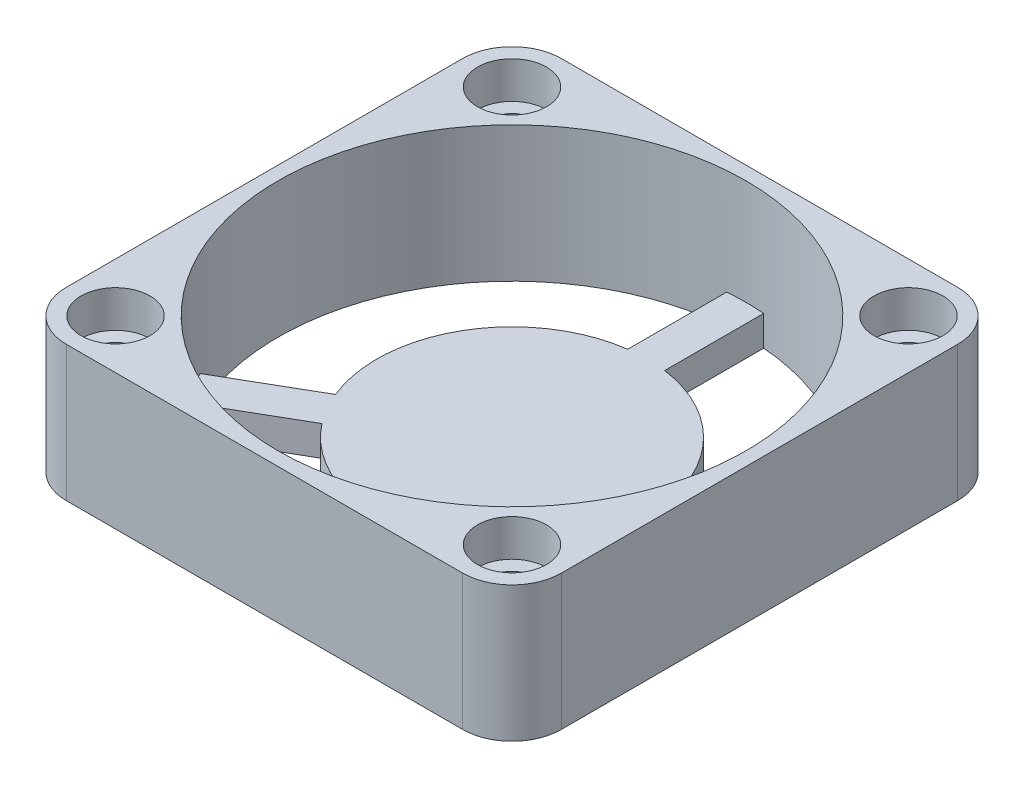
ISO-10303-21;
HEADER;
FILE_DESCRIPTION(('STEP AP214'),'2;1');
FILE_NAME('part.step','',(''),(''),'','','');
FILE_SCHEMA(('AUTOMOTIVE_DESIGN { 1 0 10303 214 1 1 1 1 }'));
ENDSEC;
DATA;
#1=APPLICATION_CONTEXT('core data for automotive mechanical design processes');
#2=APPLICATION_PROTOCOL_DEFINITION('international standard','automotive_design',2000,#1);
#3=PRODUCT_CONTEXT('',#1,'mechanical');
#4=PRODUCT('Part','Part','',(#3));
#5=PRODUCT_RELATED_PRODUCT_CATEGORY('part','',(#4));
#6=PRODUCT_DEFINITION_FORMATION('','',#4);
#7=PRODUCT_DEFINITION_CONTEXT('part definition',#1,'design');
#8=PRODUCT_DEFINITION('design','',#6,#7);
#9=PRODUCT_DEFINITION_SHAPE('','',#8);
#10=(LENGTH_UNIT() NAMED_UNIT(*) SI_UNIT(.MILLI.,.METRE.));
#11=(NAMED_UNIT(*) PLANE_ANGLE_UNIT() SI_UNIT($,.RADIAN.));
#12=(NAMED_UNIT(*) SI_UNIT($,.STERADIAN.) SOLID_ANGLE_UNIT());
#13=UNCERTAINTY_MEASURE_WITH_UNIT(LENGTH_MEASURE(1.E-05),#10,'distance_accuracy_value','');
#14=(GEOMETRIC_REPRESENTATION_CONTEXT(3) GLOBAL_UNCERTAINTY_ASSIGNED_CONTEXT((#13)) GLOBAL_UNIT_ASSIGNED_CONTEXT((#10,
#11,#12)) REPRESENTATION_CONTEXT('',''));
#15=CARTESIAN_POINT('',(0.,0.,0.));
#16=DIRECTION('',(0.,0.,1.));
#17=DIRECTION('',(1.,0.,0.));
#18=AXIS2_PLACEMENT_3D('',#15,#16,#17);
#19=CARTESIAN_POINT('',(16.1,5.5,16.1));
#20=DIRECTION('',(0.,-1.,0.));
#21=DIRECTION('',(0.,0.,-1.));
#22=AXIS2_PLACEMENT_3D('',#19,#20,#21);
#23=CYLINDRICAL_SURFACE('',#22,1.6);
#24=CARTESIAN_POINT('',(16.1,-5.5,16.1));
#25=DIRECTION('',(0.,-1.,0.));
#26=DIRECTION('',(0.,0.,1.));
#27=AXIS2_PLACEMENT_3D('',#24,#25,#26);
#28=CIRCLE('',#27,1.6);
#29=CARTESIAN_POINT('',(16.1,-5.5,17.7));
#30=VERTEX_POINT('',#29);
#31=EDGE_CURVE('E352',#30,#30,#28,.T.);
#32=ORIENTED_EDGE('',*,*,#31,.T.);
#33=EDGE_LOOP('',(#32));
#34=FACE_BOUND('',#33,.T.);
#35=CARTESIAN_POINT('',(16.1,2.5,16.1));
#36=DIRECTION('',(0.,1.,0.));
#37=DIRECTION('',(0.,0.,1.));
#38=AXIS2_PLACEMENT_3D('',#35,#36,#37);
#39=CIRCLE('',#38,1.6);
#40=CARTESIAN_POINT('',(16.1,2.5,17.7));
#41=VERTEX_POINT('',#40);
#42=EDGE_CURVE('E338',#41,#41,#39,.F.);
#43=ORIENTED_EDGE('',*,*,#42,.F.);
#44=EDGE_LOOP('',(#43));
#45=FACE_BOUND('',#44,.T.);
#46=ADVANCED_FACE('F39',(#34,#45),#23,.F.);
#47=CARTESIAN_POINT('',(-16.1,5.5,-16.1));
#48=DIRECTION('',(0.,-1.,0.));
#49=DIRECTION('',(0.,0.,-1.));
#50=AXIS2_PLACEMENT_3D('',#47,#48,#49);
#51=CYLINDRICAL_SURFACE('',#50,1.6);
#52=CARTESIAN_POINT('',(-16.1,-5.5,-16.1));
#53=DIRECTION('',(0.,-1.,0.));
#54=DIRECTION('',(0.,0.,1.));
#55=AXIS2_PLACEMENT_3D('',#52,#53,#54);
#56=CIRCLE('',#55,1.6);
#57=CARTESIAN_POINT('',(-16.1,-5.5,-14.5));
#58=VERTEX_POINT('',#57);
#59=EDGE_CURVE('E343',#58,#58,#56,.T.);
#60=ORIENTED_EDGE('',*,*,#59,.T.);
#61=EDGE_LOOP('',(#60));
#62=FACE_BOUND('',#61,.T.);
#63=CARTESIAN_POINT('',(-16.1,2.5,-16.1));
#64=DIRECTION('',(0.,1.,0.));
#65=DIRECTION('',(0.,0.,1.));
#66=AXIS2_PLACEMENT_3D('',#63,#64,#65);
#67=CIRCLE('',#66,1.6);
#68=CARTESIAN_POINT('',(-16.1,2.5,-14.5));
#69=VERTEX_POINT('',#68);
#70=EDGE_CURVE('E332',#69,#69,#67,.F.);
#71=ORIENTED_EDGE('',*,*,#70,.F.);
#72=EDGE_LOOP('',(#71));
#73=FACE_BOUND('',#72,.T.);
#74=ADVANCED_FACE('F411',(#62,#73),#51,.F.);
#75=CARTESIAN_POINT('',(16.1,5.5,16.1));
#76=DIRECTION('',(0.,-1.,0.));
#77=DIRECTION('',(0.,0.,-1.));
#78=AXIS2_PLACEMENT_3D('',#75,#76,#77);
#79=CYLINDRICAL_SURFACE('',#78,4.);
#80=CARTESIAN_POINT('',(16.1,-5.5,16.1));
#81=DIRECTION('',(0.,1.,0.));
#82=DIRECTION('',(0.,0.,1.));
#83=AXIS2_PLACEMENT_3D('',#80,#81,#82);
#84=CIRCLE('',#83,4.);
#85=CARTESIAN_POINT('',(16.1,-5.5,20.1));
#86=VERTEX_POINT('',#85);
#87=CARTESIAN_POINT('',(20.1,-5.5,16.1));
#88=VERTEX_POINT('',#87);
#89=EDGE_CURVE('E274',#86,#88,#84,.T.);
#90=ORIENTED_EDGE('',*,*,#89,.T.);
#91=DIRECTION('',(0.,-1.,0.));
#92=VECTOR('',#91,1.);
#93=CARTESIAN_POINT('',(20.1,5.5,16.1));
#94=LINE('',#93,#92);
#95=CARTESIAN_POINT('',(20.1,5.5,16.1));
#96=VERTEX_POINT('',#95);
#97=EDGE_CURVE('E11',#96,#88,#94,.T.);
#98=ORIENTED_EDGE('',*,*,#97,.F.);
#99=CARTESIAN_POINT('',(16.1,5.5,16.1));
#100=DIRECTION('',(0.,1.,0.));
#101=DIRECTION('',(0.,0.,1.));
#102=AXIS2_PLACEMENT_3D('',#99,#100,#101);
#103=CIRCLE('',#102,4.);
#104=CARTESIAN_POINT('',(16.1,5.5,20.1));
#105=VERTEX_POINT('',#104);
#106=EDGE_CURVE('E279',#105,#96,#103,.T.);
#107=ORIENTED_EDGE('',*,*,#106,.F.);
#108=DIRECTION('',(0.,-1.,0.));
#109=VECTOR('',#108,1.);
#110=CARTESIAN_POINT('',(16.1,5.5,20.1));
#111=LINE('',#110,#109);
#112=EDGE_CURVE('E297',#105,#86,#111,.T.);
#113=ORIENTED_EDGE('',*,*,#112,.T.);
#114=EDGE_LOOP('',(#90,#98,#107,#113));
#115=FACE_BOUND('',#114,.T.);
#116=ADVANCED_FACE('F41',(#115),#79,.T.);
#117=CARTESIAN_POINT('',(20.1,5.5,16.1));
#118=DIRECTION('',(-1.,0.,0.));
#119=DIRECTION('',(0.,0.,1.));
#120=AXIS2_PLACEMENT_3D('',#117,#118,#119);
#121=PLANE('',#120);
#122=DIRECTION('',(0.,0.,-1.));
#123=VECTOR('',#122,1.);
#124=CARTESIAN_POINT('',(20.1,-5.5,16.1));
#125=LINE('',#124,#123);
#126=CARTESIAN_POINT('',(20.1,-5.5,-16.1));
#127=VERTEX_POINT('',#126);
#128=EDGE_CURVE('E300',#88,#127,#125,.T.);
#129=ORIENTED_EDGE('',*,*,#128,.T.);
#130=DIRECTION('',(0.,-1.,0.));
#131=VECTOR('',#130,1.);
#132=CARTESIAN_POINT('',(20.1,5.5,-16.1));
#133=LINE('',#132,#131);
#134=CARTESIAN_POINT('',(20.1,5.5,-16.1));
#135=VERTEX_POINT('',#134);
#136=EDGE_CURVE('E48',#135,#127,#133,.T.);
#137=ORIENTED_EDGE('',*,*,#136,.F.);
#138=DIRECTION('',(0.,0.,-1.));
#139=VECTOR('',#138,1.);
#140=CARTESIAN_POINT('',(20.1,5.5,16.1));
#141=LINE('',#140,#139);
#142=EDGE_CURVE('E282',#96,#135,#141,.T.);
#143=ORIENTED_EDGE('',*,*,#142,.F.);
#144=ORIENTED_EDGE('',*,*,#97,.T.);
#145=EDGE_LOOP('',(#129,#137,#143,#144));
#146=FACE_BOUND('',#145,.T.);
#147=ADVANCED_FACE('F719',(#146),#121,.F.);
#148=CARTESIAN_POINT('',(16.1,5.5,-16.1));
#149=DIRECTION('',(0.,-1.,0.));
#150=DIRECTION('',(0.,0.,-1.));
#151=AXIS2_PLACEMENT_3D('',#148,#149,#150);
#152=CYLINDRICAL_SURFACE('',#151,4.);
#153=CARTESIAN_POINT('',(16.1,-5.5,-16.1));
#154=DIRECTION('',(0.,1.,0.));
#155=DIRECTION('',(0.,0.,-1.));
#156=AXIS2_PLACEMENT_3D('',#153,#154,#155);
#157=CIRCLE('',#156,4.);
#158=CARTESIAN_POINT('',(16.1,-5.5,-20.1));
#159=VERTEX_POINT('',#158);
#160=EDGE_CURVE('E302',#127,#159,#157,.T.);
#161=ORIENTED_EDGE('',*,*,#160,.T.);
#162=DIRECTION('',(0.,-1.,0.));
#163=VECTOR('',#162,1.);
#164=CARTESIAN_POINT('',(16.1,5.5,-20.1));
#165=LINE('',#164,#163);
#166=CARTESIAN_POINT('',(16.1,5.5,-20.1));
#167=VERTEX_POINT('',#166);
#168=EDGE_CURVE('E327',#167,#159,#165,.T.);
#169=ORIENTED_EDGE('',*,*,#168,.F.);
#170=CARTESIAN_POINT('',(16.1,5.5,-16.1));
#171=DIRECTION('',(0.,1.,0.));
#172=DIRECTION('',(0.,0.,-1.));
#173=AXIS2_PLACEMENT_3D('',#170,#171,#172);
#174=CIRCLE('',#173,4.);
#175=EDGE_CURVE('E285',#135,#167,#174,.T.);
#176=ORIENTED_EDGE('',*,*,#175,.F.);
#177=ORIENTED_EDGE('',*,*,#136,.T.);
#178=EDGE_LOOP('',(#161,#169,#176,#177));
#179=FACE_BOUND('',#178,.T.);
#180=ADVANCED_FACE('F708',(#179),#152,.T.);
#181=CARTESIAN_POINT('',(-16.1,5.5,-20.1));
#182=DIRECTION('',(0.,0.,1.));
#183=DIRECTION('',(1.,0.,0.));
#184=AXIS2_PLACEMENT_3D('',#181,#182,#183);
#185=PLANE('',#184);
#186=DIRECTION('',(-1.,0.,0.));
#187=VECTOR('',#186,1.);
#188=CARTESIAN_POINT('',(-16.1,-5.5,-20.1));
#189=LINE('',#188,#187);
#190=CARTESIAN_POINT('',(-16.1,-5.5,-20.1));
#191=VERTEX_POINT('',#190);
#192=EDGE_CURVE('E304',#159,#191,#189,.T.);
#193=ORIENTED_EDGE('',*,*,#192,.T.);
#194=DIRECTION('',(0.,-1.,0.));
#195=VECTOR('',#194,1.);
#196=CARTESIAN_POINT('',(-16.1,5.5,-20.1));
#197=LINE('',#196,#195);
#198=CARTESIAN_POINT('',(-16.1,5.5,-20.1));
#199=VERTEX_POINT('',#198);
#200=EDGE_CURVE('E324',#199,#191,#197,.T.);
#201=ORIENTED_EDGE('',*,*,#200,.F.);
#202=DIRECTION('',(-1.,0.,0.));
#203=VECTOR('',#202,1.);
#204=CARTESIAN_POINT('',(-16.1,5.5,-20.1));
#205=LINE('',#204,#203);
#206=EDGE_CURVE('E287',#167,#199,#205,.T.);
#207=ORIENTED_EDGE('',*,*,#206,.F.);
#208=ORIENTED_EDGE('',*,*,#168,.T.);
#209=EDGE_LOOP('',(#193,#201,#207,#208));
#210=FACE_BOUND('',#209,.T.);
#211=ADVANCED_FACE('F697',(#210),#185,.F.);
#212=CARTESIAN_POINT('',(-16.1,5.5,-16.1));
#213=DIRECTION('',(0.,-1.,0.));
#214=DIRECTION('',(0.,0.,-1.));
#215=AXIS2_PLACEMENT_3D('',#212,#213,#214);
#216=CYLINDRICAL_SURFACE('',#215,4.);
#217=CARTESIAN_POINT('',(-16.1,-5.5,-16.1));
#218=DIRECTION('',(0.,1.,0.));
#219=DIRECTION('',(0.,0.,-1.));
#220=AXIS2_PLACEMENT_3D('',#217,#218,#219);
#221=CIRCLE('',#220,4.);
#222=CARTESIAN_POINT('',(-20.1,-5.5,-16.1));
#223=VERTEX_POINT('',#222);
#224=EDGE_CURVE('E306',#191,#223,#221,.T.);
#225=ORIENTED_EDGE('',*,*,#224,.T.);
#226=DIRECTION('',(0.,-1.,0.));
#227=VECTOR('',#226,1.);
#228=CARTESIAN_POINT('',(-20.1,5.5,-16.1));
#229=LINE('',#228,#227);
#230=CARTESIAN_POINT('',(-20.1,5.5,-16.1));
#231=VERTEX_POINT('',#230);
#232=EDGE_CURVE('E321',#231,#223,#229,.T.);
#233=ORIENTED_EDGE('',*,*,#232,.F.);
#234=CARTESIAN_POINT('',(-16.1,5.5,-16.1));
#235=DIRECTION('',(0.,1.,0.));
#236=DIRECTION('',(0.,0.,-1.));
#237=AXIS2_PLACEMENT_3D('',#234,#235,#236);
#238=CIRCLE('',#237,4.);
#239=EDGE_CURVE('E289',#199,#231,#238,.T.);
#240=ORIENTED_EDGE('',*,*,#239,.F.);
#241=ORIENTED_EDGE('',*,*,#200,.T.);
#242=EDGE_LOOP('',(#225,#233,#240,#241));
#243=FACE_BOUND('',#242,.T.);
#244=ADVANCED_FACE('F686',(#243),#216,.T.);
#245=CARTESIAN_POINT('',(-20.1,5.5,16.1));
#246=DIRECTION('',(1.,0.,0.));
#247=DIRECTION('',(0.,0.,-1.));
#248=AXIS2_PLACEMENT_3D('',#245,#246,#247);
#249=PLANE('',#248);
#250=DIRECTION('',(0.,0.,1.));
#251=VECTOR('',#250,1.);
#252=CARTESIAN_POINT('',(-20.1,-5.5,16.1));
#253=LINE('',#252,#251);
#254=CARTESIAN_POINT('',(-20.1,-5.5,16.1));
#255=VERTEX_POINT('',#254);
#256=EDGE_CURVE('E308',#223,#255,#253,.T.);
#257=ORIENTED_EDGE('',*,*,#256,.T.);
#258=DIRECTION('',(0.,-1.,0.));
#259=VECTOR('',#258,1.);
#260=CARTESIAN_POINT('',(-20.1,5.5,16.1));
#261=LINE('',#260,#259);
#262=CARTESIAN_POINT('',(-20.1,5.5,16.1));
#263=VERTEX_POINT('',#262);
#264=EDGE_CURVE('E318',#263,#255,#261,.T.);
#265=ORIENTED_EDGE('',*,*,#264,.F.);
#266=DIRECTION('',(0.,0.,1.));
#267=VECTOR('',#266,1.);
#268=CARTESIAN_POINT('',(-20.1,5.5,16.1));
#269=LINE('',#268,#267);
#270=EDGE_CURVE('E291',#231,#263,#269,.T.);
#271=ORIENTED_EDGE('',*,*,#270,.F.);
#272=ORIENTED_EDGE('',*,*,#232,.T.);
#273=EDGE_LOOP('',(#257,#265,#271,#272));
#274=FACE_BOUND('',#273,.T.);
#275=ADVANCED_FACE('F675',(#274),#249,.F.);
#276=CARTESIAN_POINT('',(-16.1,5.5,16.1));
#277=DIRECTION('',(0.,-1.,0.));
#278=DIRECTION('',(0.,0.,-1.));
#279=AXIS2_PLACEMENT_3D('',#276,#277,#278);
#280=CYLINDRICAL_SURFACE('',#279,3.99999999999999);
#281=CARTESIAN_POINT('',(-16.1,-5.5,16.1));
#282=DIRECTION('',(0.,1.,0.));
#283=DIRECTION('',(0.,0.,-1.));
#284=AXIS2_PLACEMENT_3D('',#281,#282,#283);
#285=CIRCLE('',#284,3.99999999999999);
#286=CARTESIAN_POINT('',(-16.1,-5.5,20.1));
#287=VERTEX_POINT('',#286);
#288=EDGE_CURVE('E310',#255,#287,#285,.T.);
#289=ORIENTED_EDGE('',*,*,#288,.T.);
#290=DIRECTION('',(0.,-1.,0.));
#291=VECTOR('',#290,1.);
#292=CARTESIAN_POINT('',(-16.1,5.5,20.1));
#293=LINE('',#292,#291);
#294=CARTESIAN_POINT('',(-16.1,5.5,20.1));
#295=VERTEX_POINT('',#294);
#296=EDGE_CURVE('E315',#295,#287,#293,.T.);
#297=ORIENTED_EDGE('',*,*,#296,.F.);
#298=CARTESIAN_POINT('',(-16.1,5.5,16.1));
#299=DIRECTION('',(0.,1.,0.));
#300=DIRECTION('',(0.,0.,-1.));
#301=AXIS2_PLACEMENT_3D('',#298,#299,#300);
#302=CIRCLE('',#301,3.99999999999999);
#303=EDGE_CURVE('E293',#263,#295,#302,.T.);
#304=ORIENTED_EDGE('',*,*,#303,.F.);
#305=ORIENTED_EDGE('',*,*,#264,.T.);
#306=EDGE_LOOP('',(#289,#297,#304,#305));
#307=FACE_BOUND('',#306,.T.);
#308=ADVANCED_FACE('F664',(#307),#280,.T.);
#309=CARTESIAN_POINT('',(-16.1,5.5,20.1));
#310=DIRECTION('',(0.,0.,-1.));
#311=DIRECTION('',(-1.,0.,0.));
#312=AXIS2_PLACEMENT_3D('',#309,#310,#311);
#313=PLANE('',#312);
#314=DIRECTION('',(1.,0.,0.));
#315=VECTOR('',#314,1.);
#316=CARTESIAN_POINT('',(-16.1,-5.5,20.1));
#317=LINE('',#316,#315);
#318=EDGE_CURVE('E283',#287,#86,#317,.T.);
#319=ORIENTED_EDGE('',*,*,#318,.T.);
#320=ORIENTED_EDGE('',*,*,#112,.F.);
#321=DIRECTION('',(1.,0.,0.));
#322=VECTOR('',#321,1.);
#323=CARTESIAN_POINT('',(-16.1,5.5,20.1));
#324=LINE('',#323,#322);
#325=EDGE_CURVE('E295',#295,#105,#324,.T.);
#326=ORIENTED_EDGE('',*,*,#325,.F.);
#327=ORIENTED_EDGE('',*,*,#296,.T.);
#328=EDGE_LOOP('',(#319,#320,#326,#327));
#329=FACE_BOUND('',#328,.T.);
#330=ADVANCED_FACE('F405',(#329),#313,.F.);
#331=CARTESIAN_POINT('',(16.1,5.5,16.1));
#332=DIRECTION('',(0.,1.,0.));
#333=DIRECTION('',(0.,0.,1.));
#334=AXIS2_PLACEMENT_3D('',#331,#332,#333);
#335=PLANE('',#334);
#336=CARTESIAN_POINT('',(16.1,5.5,-16.1));
#337=DIRECTION('',(0.,1.,0.));
#338=DIRECTION('',(0.,0.,-1.));
#339=AXIS2_PLACEMENT_3D('',#336,#337,#338);
#340=CIRCLE('',#339,2.8);
#341=CARTESIAN_POINT('',(16.1,5.5,-18.9));
#342=VERTEX_POINT('',#341);
#343=EDGE_CURVE('E819',#342,#342,#340,.T.);
#344=ORIENTED_EDGE('',*,*,#343,.F.);
#345=EDGE_LOOP('',(#344));
#346=FACE_BOUND('',#345,.T.);
#347=CARTESIAN_POINT('',(16.1,5.5,16.1));
#348=DIRECTION('',(0.,1.,0.));
#349=DIRECTION('',(0.,0.,1.));
#350=AXIS2_PLACEMENT_3D('',#347,#348,#349);
#351=CIRCLE('',#350,2.8);
#352=CARTESIAN_POINT('',(16.1,5.5,18.9));
#353=VERTEX_POINT('',#352);
#354=EDGE_CURVE('E811',#353,#353,#351,.T.);
#355=ORIENTED_EDGE('',*,*,#354,.F.);
#356=EDGE_LOOP('',(#355));
#357=FACE_BOUND('',#356,.T.);
#358=CARTESIAN_POINT('',(-16.1,5.5,16.1));
#359=DIRECTION('',(0.,1.,0.));
#360=DIRECTION('',(0.,0.,-1.));
#361=AXIS2_PLACEMENT_3D('',#358,#359,#360);
#362=CIRCLE('',#361,2.8);
#363=CARTESIAN_POINT('',(-16.1,5.5,13.3));
#364=VERTEX_POINT('',#363);
#365=EDGE_CURVE('E805',#364,#364,#362,.T.);
#366=ORIENTED_EDGE('',*,*,#365,.F.);
#367=EDGE_LOOP('',(#366));
#368=FACE_BOUND('',#367,.T.);
#369=CARTESIAN_POINT('',(-16.1,5.5,-16.1));
#370=DIRECTION('',(0.,1.,0.));
#371=DIRECTION('',(0.,0.,1.));
#372=AXIS2_PLACEMENT_3D('',#369,#370,#371);
#373=CIRCLE('',#372,2.8);
#374=CARTESIAN_POINT('',(-16.1,5.5,-13.3));
#375=VERTEX_POINT('',#374);
#376=EDGE_CURVE('E807',#375,#375,#373,.T.);
#377=ORIENTED_EDGE('',*,*,#376,.F.);
#378=EDGE_LOOP('',(#377));
#379=FACE_BOUND('',#378,.T.);
#380=CARTESIAN_POINT('',(0.,5.5,0.));
#381=DIRECTION('',(0.,1.,0.));
#382=DIRECTION('',(0.,0.,1.));
#383=AXIS2_PLACEMENT_3D('',#380,#381,#382);
#384=CIRCLE('',#383,19.);
#385=CARTESIAN_POINT('',(0.,5.5,19.));
#386=VERTEX_POINT('',#385);
#387=EDGE_CURVE('E266',#386,#386,#384,.T.);
#388=ORIENTED_EDGE('',*,*,#387,.F.);
#389=EDGE_LOOP('',(#388));
#390=FACE_BOUND('',#389,.T.);
#391=ORIENTED_EDGE('',*,*,#106,.T.);
#392=ORIENTED_EDGE('',*,*,#142,.T.);
#393=ORIENTED_EDGE('',*,*,#175,.T.);
#394=ORIENTED_EDGE('',*,*,#206,.T.);
#395=ORIENTED_EDGE('',*,*,#239,.T.);
#396=ORIENTED_EDGE('',*,*,#270,.T.);
#397=ORIENTED_EDGE('',*,*,#303,.T.);
#398=ORIENTED_EDGE('',*,*,#325,.T.);
#399=EDGE_LOOP('',(#391,#392,#393,#394,#395,#396,#397,#398));
#400=FACE_BOUND('',#399,.T.);
#401=ADVANCED_FACE('F397',(#346,#357,#368,#379,#390,#400),#335,.T.);
#402=CARTESIAN_POINT('',(16.1,-5.5,16.1));
#403=DIRECTION('',(0.,1.,0.));
#404=DIRECTION('',(0.,0.,1.));
#405=AXIS2_PLACEMENT_3D('',#402,#403,#404);
#406=PLANE('',#405);
#407=ORIENTED_EDGE('',*,*,#59,.F.);
#408=EDGE_LOOP('',(#407));
#409=FACE_BOUND('',#408,.T.);
#410=CARTESIAN_POINT('',(16.1,-5.5,-16.1));
#411=DIRECTION('',(0.,-1.,0.));
#412=DIRECTION('',(0.,0.,-1.));
#413=AXIS2_PLACEMENT_3D('',#410,#411,#412);
#414=CIRCLE('',#413,1.6);
#415=CARTESIAN_POINT('',(16.1,-5.5,-17.7));
#416=VERTEX_POINT('',#415);
#417=EDGE_CURVE('E347',#416,#416,#414,.T.);
#418=ORIENTED_EDGE('',*,*,#417,.F.);
#419=EDGE_LOOP('',(#418));
#420=FACE_BOUND('',#419,.T.);
#421=ORIENTED_EDGE('',*,*,#31,.F.);
#422=EDGE_LOOP('',(#421));
#423=FACE_BOUND('',#422,.T.);
#424=CARTESIAN_POINT('',(-16.1,-5.5,16.1));
#425=DIRECTION('',(0.,-1.,0.));
#426=DIRECTION('',(0.,0.,-1.));
#427=AXIS2_PLACEMENT_3D('',#424,#425,#426);
#428=CIRCLE('',#427,1.6);
#429=CARTESIAN_POINT('',(-16.1,-5.5,14.5));
#430=VERTEX_POINT('',#429);
#431=EDGE_CURVE('E229',#430,#430,#428,.T.);
#432=ORIENTED_EDGE('',*,*,#431,.F.);
#433=EDGE_LOOP('',(#432));
#434=FACE_BOUND('',#433,.T.);
#435=DIRECTION('',(0.,0.,-1.));
#436=VECTOR('',#435,1.);
#437=CARTESIAN_POINT('',(-1.5,-5.5,-10.8972473588517));
#438=LINE('',#437,#436);
#439=CARTESIAN_POINT('',(-1.5,-5.5,-10.8972473588517));
#440=VERTEX_POINT('',#439);
#441=CARTESIAN_POINT('',(-1.5,-5.5,-18.9406969248758));
#442=VERTEX_POINT('',#441);
#443=EDGE_CURVE('E222',#440,#442,#438,.T.);
#444=ORIENTED_EDGE('',*,*,#443,.T.);
#445=CARTESIAN_POINT('',(0.,-5.5,0.));
#446=DIRECTION('',(0.,1.,0.));
#447=DIRECTION('',(0.,0.,1.));
#448=AXIS2_PLACEMENT_3D('',#445,#446,#447);
#449=CIRCLE('',#448,19.);
#450=CARTESIAN_POINT('',(-17.1531247023238,-5.5,8.17131035676223));
#451=VERTEX_POINT('',#450);
#452=EDGE_CURVE('E233',#442,#451,#449,.T.);
#453=ORIENTED_EDGE('',*,*,#452,.T.);
#454=DIRECTION('',(0.866025403784439,0.,-0.5));
#455=VECTOR('',#454,1.);
#456=CARTESIAN_POINT('',(-10.187293044088,-5.5,4.14958557375019));
#457=LINE('',#456,#455);
#458=CARTESIAN_POINT('',(-10.187293044088,-5.5,4.14958557375019));
#459=VERTEX_POINT('',#458);
#460=EDGE_CURVE('E242',#451,#459,#457,.T.);
#461=ORIENTED_EDGE('',*,*,#460,.T.);
#462=CARTESIAN_POINT('',(0.,-5.5,0.));
#463=DIRECTION('',(0.,-1.,0.));
#464=DIRECTION('',(0.,0.,1.));
#465=AXIS2_PLACEMENT_3D('',#462,#463,#464);
#466=CIRCLE('',#465,11.);
#467=EDGE_CURVE('E239',#459,#440,#466,.T.);
#468=ORIENTED_EDGE('',*,*,#467,.T.);
#469=EDGE_LOOP('',(#444,#453,#461,#468));
#470=FACE_BOUND('',#469,.T.);
#471=DIRECTION('',(0.,0.,1.));
#472=VECTOR('',#471,1.);
#473=CARTESIAN_POINT('',(1.5,-5.5,-10.8972473588517));
#474=LINE('',#473,#472);
#475=CARTESIAN_POINT('',(1.5,-5.5,-18.9406969248758));
#476=VERTEX_POINT('',#475);
#477=CARTESIAN_POINT('',(1.5,-5.5,-10.8972473588517));
#478=VERTEX_POINT('',#477);
#479=EDGE_CURVE('E210',#476,#478,#474,.T.);
#480=ORIENTED_EDGE('',*,*,#479,.T.);
#481=CARTESIAN_POINT('',(0.,-5.5,0.));
#482=DIRECTION('',(0.,-1.,0.));
#483=DIRECTION('',(0.,0.,1.));
#484=AXIS2_PLACEMENT_3D('',#481,#482,#483);
#485=CIRCLE('',#484,11.);
#486=CARTESIAN_POINT('',(10.1872930440884,-5.5,4.14958557374918));
#487=VERTEX_POINT('',#486);
#488=EDGE_CURVE('E185',#478,#487,#485,.T.);
#489=ORIENTED_EDGE('',*,*,#488,.T.);
#490=DIRECTION('',(0.866025403784439,0.,0.5));
#491=VECTOR('',#490,1.);
#492=CARTESIAN_POINT('',(10.1872930440884,-5.5,4.14958557374918));
#493=LINE('',#492,#491);
#494=CARTESIAN_POINT('',(17.1531247023243,-5.5,8.17131035676125));
#495=VERTEX_POINT('',#494);
#496=EDGE_CURVE('E216',#487,#495,#493,.T.);
#497=ORIENTED_EDGE('',*,*,#496,.T.);
#498=CARTESIAN_POINT('',(0.,-5.5,0.));
#499=DIRECTION('',(0.,1.,0.));
#500=DIRECTION('',(0.,0.,1.));
#501=AXIS2_PLACEMENT_3D('',#498,#499,#500);
#502=CIRCLE('',#501,19.);
#503=EDGE_CURVE('E212',#495,#476,#502,.T.);
#504=ORIENTED_EDGE('',*,*,#503,.T.);
#505=EDGE_LOOP('',(#480,#489,#497,#504));
#506=FACE_BOUND('',#505,.T.);
#507=DIRECTION('',(-0.866025403784439,0.,0.5));
#508=VECTOR('',#507,1.);
#509=CARTESIAN_POINT('',(-8.68729304408777,-5.5,6.74766178510336));
#510=LINE('',#509,#508);
#511=CARTESIAN_POINT('',(-8.68729304408777,-5.5,6.74766178510336));
#512=VERTEX_POINT('',#511);
#513=CARTESIAN_POINT('',(-15.6531247023237,-5.5,10.7693865681155));
#514=VERTEX_POINT('',#513);
#515=EDGE_CURVE('E257',#512,#514,#510,.T.);
#516=ORIENTED_EDGE('',*,*,#515,.T.);
#517=CARTESIAN_POINT('',(0.,-5.5,0.));
#518=DIRECTION('',(0.,1.,0.));
#519=DIRECTION('',(0.,0.,1.));
#520=AXIS2_PLACEMENT_3D('',#517,#518,#519);
#521=CIRCLE('',#520,19.);
#522=CARTESIAN_POINT('',(15.6531247023243,-5.5,10.7693865681146));
#523=VERTEX_POINT('',#522);
#524=EDGE_CURVE('E247',#514,#523,#521,.T.);
#525=ORIENTED_EDGE('',*,*,#524,.T.);
#526=DIRECTION('',(-0.866025403784439,0.,-0.5));
#527=VECTOR('',#526,1.);
#528=CARTESIAN_POINT('',(8.68729304408844,-5.5,6.7476617851025));
#529=LINE('',#528,#527);
#530=CARTESIAN_POINT('',(8.68729304408844,-5.5,6.7476617851025));
#531=VERTEX_POINT('',#530);
#532=EDGE_CURVE('E250',#523,#531,#529,.T.);
#533=ORIENTED_EDGE('',*,*,#532,.T.);
#534=CARTESIAN_POINT('',(0.,-5.5,0.));
#535=DIRECTION('',(0.,-1.,0.));
#536=DIRECTION('',(0.,0.,1.));
#537=AXIS2_PLACEMENT_3D('',#534,#535,#536);
#538=CIRCLE('',#537,11.);
#539=EDGE_CURVE('E254',#531,#512,#538,.T.);
#540=ORIENTED_EDGE('',*,*,#539,.T.);
#541=EDGE_LOOP('',(#516,#525,#533,#540));
#542=FACE_BOUND('',#541,.T.);
#543=ORIENTED_EDGE('',*,*,#89,.F.);
#544=ORIENTED_EDGE('',*,*,#318,.F.);
#545=ORIENTED_EDGE('',*,*,#288,.F.);
#546=ORIENTED_EDGE('',*,*,#256,.F.);
#547=ORIENTED_EDGE('',*,*,#224,.F.);
#548=ORIENTED_EDGE('',*,*,#192,.F.);
#549=ORIENTED_EDGE('',*,*,#160,.F.);
#550=ORIENTED_EDGE('',*,*,#128,.F.);
#551=EDGE_LOOP('',(#543,#544,#545,#546,#547,#548,#549,#550));
#552=FACE_BOUND('',#551,.T.);
#553=ADVANCED_FACE('F379',(#409,#420,#423,#434,#470,#506,#542,#552),#406,.F.);
#554=CARTESIAN_POINT('',(0.,-3.05,0.));
#555=DIRECTION('',(0.,1.,0.));
#556=DIRECTION('',(0.,0.,1.));
#557=AXIS2_PLACEMENT_3D('',#554,#555,#556);
#558=CYLINDRICAL_SURFACE('',#557,19.);
#559=CARTESIAN_POINT('',(0.,-3.05,0.));
#560=DIRECTION('',(0.,1.,0.));
#561=DIRECTION('',(0.,0.,1.));
#562=AXIS2_PLACEMENT_3D('',#559,#560,#561);
#563=CIRCLE('',#562,19.);
#564=CARTESIAN_POINT('',(15.6531247023243,-3.05,10.7693865681146));
#565=VERTEX_POINT('',#564);
#566=CARTESIAN_POINT('',(17.1531247023243,-3.05,8.17131035676125));
#567=VERTEX_POINT('',#566);
#568=EDGE_CURVE('E272',#565,#567,#563,.T.);
#569=ORIENTED_EDGE('',*,*,#568,.F.);
#570=DIRECTION('',(0.,1.,0.));
#571=VECTOR('',#570,1.);
#572=CARTESIAN_POINT('',(15.6531247023243,-5.5,10.7693865681146));
#573=LINE('',#572,#571);
#574=EDGE_CURVE('E259',#523,#565,#573,.T.);
#575=ORIENTED_EDGE('',*,*,#574,.F.);
#576=ORIENTED_EDGE('',*,*,#524,.F.);
#577=DIRECTION('',(0.,1.,0.));
#578=VECTOR('',#577,1.);
#579=CARTESIAN_POINT('',(-15.6531247023237,-5.5,10.7693865681155));
#580=LINE('',#579,#578);
#581=CARTESIAN_POINT('',(-15.6531247023237,-3.05,10.7693865681155));
#582=VERTEX_POINT('',#581);
#583=EDGE_CURVE('E264',#514,#582,#580,.T.);
#584=ORIENTED_EDGE('',*,*,#583,.T.);
#585=CARTESIAN_POINT('',(-17.1531247023238,-3.05,8.17131035676223));
#586=VERTEX_POINT('',#585);
#587=EDGE_CURVE('E276',#586,#582,#563,.T.);
#588=ORIENTED_EDGE('',*,*,#587,.F.);
#589=DIRECTION('',(0.,1.,0.));
#590=VECTOR('',#589,1.);
#591=CARTESIAN_POINT('',(-17.1531247023238,-5.5,8.17131035676223));
#592=LINE('',#591,#590);
#593=EDGE_CURVE('E220',#451,#586,#592,.T.);
#594=ORIENTED_EDGE('',*,*,#593,.F.);
#595=ORIENTED_EDGE('',*,*,#452,.F.);
#596=DIRECTION('',(0.,1.,0.));
#597=VECTOR('',#596,1.);
#598=CARTESIAN_POINT('',(-1.5,-5.5,-18.9406969248758));
#599=LINE('',#598,#597);
#600=CARTESIAN_POINT('',(-1.5,-3.05,-18.9406969248758));
#601=VERTEX_POINT('',#600);
#602=EDGE_CURVE('E227',#442,#601,#599,.T.);
#603=ORIENTED_EDGE('',*,*,#602,.T.);
#604=CARTESIAN_POINT('',(1.5,-3.05,-18.9406969248758));
#605=VERTEX_POINT('',#604);
#606=EDGE_CURVE('E275',#605,#601,#563,.T.);
#607=ORIENTED_EDGE('',*,*,#606,.F.);
#608=DIRECTION('',(0.,1.,0.));
#609=VECTOR('',#608,1.);
#610=CARTESIAN_POINT('',(1.5,-5.5,-18.9406969248758));
#611=LINE('',#610,#609);
#612=EDGE_CURVE('E189',#476,#605,#611,.T.);
#613=ORIENTED_EDGE('',*,*,#612,.F.);
#614=ORIENTED_EDGE('',*,*,#503,.F.);
#615=DIRECTION('',(0.,1.,0.));
#616=VECTOR('',#615,1.);
#617=CARTESIAN_POINT('',(17.1531247023243,-5.5,8.17131035676125));
#618=LINE('',#617,#616);
#619=EDGE_CURVE('E359',#495,#567,#618,.T.);
#620=ORIENTED_EDGE('',*,*,#619,.T.);
#621=EDGE_LOOP('',(#569,#575,#576,#584,#588,#594,#595,#603,#607,#613,#614,#620));
#622=FACE_BOUND('',#621,.T.);
#623=ORIENTED_EDGE('',*,*,#387,.T.);
#624=EDGE_LOOP('',(#623));
#625=FACE_BOUND('',#624,.T.);
#626=ADVANCED_FACE('F364',(#622,#625),#558,.F.);
#627=CARTESIAN_POINT('',(0.,-3.05,0.));
#628=DIRECTION('',(0.,1.,0.));
#629=DIRECTION('',(0.,0.,1.));
#630=AXIS2_PLACEMENT_3D('',#627,#628,#629);
#631=PLANE('',#630);
#632=DIRECTION('',(0.866025403784439,0.,-0.5));
#633=VECTOR('',#632,1.);
#634=CARTESIAN_POINT('',(-10.187293044088,-3.05,4.14958557375019));
#635=LINE('',#634,#633);
#636=CARTESIAN_POINT('',(-10.187293044088,-3.05,4.14958557375019));
#637=VERTEX_POINT('',#636);
#638=EDGE_CURVE('E190',#586,#637,#635,.T.);
#639=ORIENTED_EDGE('',*,*,#638,.F.);
#640=ORIENTED_EDGE('',*,*,#587,.T.);
#641=DIRECTION('',(-0.866025403784439,0.,0.5));
#642=VECTOR('',#641,1.);
#643=CARTESIAN_POINT('',(-8.68729304408777,-3.05,6.74766178510336));
#644=LINE('',#643,#642);
#645=CARTESIAN_POINT('',(-8.68729304408777,-3.05,6.74766178510336));
#646=VERTEX_POINT('',#645);
#647=EDGE_CURVE('E251',#646,#582,#644,.T.);
#648=ORIENTED_EDGE('',*,*,#647,.F.);
#649=CARTESIAN_POINT('',(0.,-3.05,0.));
#650=DIRECTION('',(0.,-1.,0.));
#651=DIRECTION('',(0.,0.,1.));
#652=AXIS2_PLACEMENT_3D('',#649,#650,#651);
#653=CIRCLE('',#652,11.);
#654=CARTESIAN_POINT('',(8.68729304408844,-3.05,6.7476617851025));
#655=VERTEX_POINT('',#654);
#656=EDGE_CURVE('E64',#655,#646,#653,.T.);
#657=ORIENTED_EDGE('',*,*,#656,.F.);
#658=DIRECTION('',(-0.866025403784439,0.,-0.5));
#659=VECTOR('',#658,1.);
#660=CARTESIAN_POINT('',(8.68729304408844,-3.05,6.7476617851025));
#661=LINE('',#660,#659);
#662=EDGE_CURVE('E204',#565,#655,#661,.T.);
#663=ORIENTED_EDGE('',*,*,#662,.F.);
#664=ORIENTED_EDGE('',*,*,#568,.T.);
#665=DIRECTION('',(0.866025403784439,0.,0.5));
#666=VECTOR('',#665,1.);
#667=CARTESIAN_POINT('',(10.1872930440884,-3.05,4.14958557374918));
#668=LINE('',#667,#666);
#669=CARTESIAN_POINT('',(10.1872930440884,-3.05,4.14958557374918));
#670=VERTEX_POINT('',#669);
#671=EDGE_CURVE('E198',#670,#567,#668,.T.);
#672=ORIENTED_EDGE('',*,*,#671,.F.);
#673=CARTESIAN_POINT('',(0.,-3.05,0.));
#674=DIRECTION('',(0.,-1.,0.));
#675=DIRECTION('',(0.,0.,1.));
#676=AXIS2_PLACEMENT_3D('',#673,#674,#675);
#677=CIRCLE('',#676,11.);
#678=CARTESIAN_POINT('',(1.5,-3.05,-10.8972473588517));
#679=VERTEX_POINT('',#678);
#680=EDGE_CURVE('E182',#679,#670,#677,.T.);
#681=ORIENTED_EDGE('',*,*,#680,.F.);
#682=DIRECTION('',(0.,0.,1.));
#683=VECTOR('',#682,1.);
#684=CARTESIAN_POINT('',(1.5,-3.05,-10.8972473588517));
#685=LINE('',#684,#683);
#686=EDGE_CURVE('E193',#605,#679,#685,.T.);
#687=ORIENTED_EDGE('',*,*,#686,.F.);
#688=ORIENTED_EDGE('',*,*,#606,.T.);
#689=DIRECTION('',(0.,0.,-1.));
#690=VECTOR('',#689,1.);
#691=CARTESIAN_POINT('',(-1.5,-3.05,-10.8972473588517));
#692=LINE('',#691,#690);
#693=CARTESIAN_POINT('',(-1.5,-3.05,-10.8972473588517));
#694=VERTEX_POINT('',#693);
#695=EDGE_CURVE('E230',#694,#601,#692,.T.);
#696=ORIENTED_EDGE('',*,*,#695,.F.);
#697=CARTESIAN_POINT('',(0.,-3.05,0.));
#698=DIRECTION('',(0.,-1.,0.));
#699=DIRECTION('',(0.,0.,1.));
#700=AXIS2_PLACEMENT_3D('',#697,#698,#699);
#701=CIRCLE('',#700,11.);
#702=EDGE_CURVE('E56',#637,#694,#701,.T.);
#703=ORIENTED_EDGE('',*,*,#702,.F.);
#704=EDGE_LOOP('',(#639,#640,#648,#657,#663,#664,#672,#681,#687,#688,#696,#703));
#705=FACE_BOUND('',#704,.T.);
#706=ADVANCED_FACE('F201',(#705),#631,.T.);
#707=CARTESIAN_POINT('',(-8.68729304408777,-5.5,6.74766178510336));
#708=DIRECTION('',(-0.5,0.,-0.866025403784439));
#709=DIRECTION('',(-0.866025403784439,0.,0.5));
#710=AXIS2_PLACEMENT_3D('',#707,#708,#709);
#711=PLANE('',#710);
#712=ORIENTED_EDGE('',*,*,#647,.T.);
#713=ORIENTED_EDGE('',*,*,#583,.F.);
#714=ORIENTED_EDGE('',*,*,#515,.F.);
#715=DIRECTION('',(0.,1.,0.));
#716=VECTOR('',#715,1.);
#717=CARTESIAN_POINT('',(-8.68729304408777,-5.5,6.74766178510336));
#718=LINE('',#717,#716);
#719=EDGE_CURVE('E267',#512,#646,#718,.T.);
#720=ORIENTED_EDGE('',*,*,#719,.T.);
#721=EDGE_LOOP('',(#712,#713,#714,#720));
#722=FACE_BOUND('',#721,.T.);
#723=ADVANCED_FACE('F382',(#722),#711,.F.);
#724=CARTESIAN_POINT('',(0.,-5.5,0.));
#725=DIRECTION('',(0.,1.,0.));
#726=DIRECTION('',(0.,0.,1.));
#727=AXIS2_PLACEMENT_3D('',#724,#725,#726);
#728=CYLINDRICAL_SURFACE('',#727,11.);
#729=ORIENTED_EDGE('',*,*,#656,.T.);
#730=ORIENTED_EDGE('',*,*,#719,.F.);
#731=ORIENTED_EDGE('',*,*,#539,.F.);
#732=DIRECTION('',(0.,1.,0.));
#733=VECTOR('',#732,1.);
#734=CARTESIAN_POINT('',(8.68729304408844,-5.5,6.7476617851025));
#735=LINE('',#734,#733);
#736=EDGE_CURVE('E269',#531,#655,#735,.T.);
#737=ORIENTED_EDGE('',*,*,#736,.T.);
#738=EDGE_LOOP('',(#729,#730,#731,#737));
#739=FACE_BOUND('',#738,.T.);
#740=ADVANCED_FACE('F446',(#739),#728,.T.);
#741=CARTESIAN_POINT('',(8.68729304408844,-5.5,6.7476617851025));
#742=DIRECTION('',(0.5,0.,-0.866025403784439));
#743=DIRECTION('',(-0.866025403784439,0.,-0.5));
#744=AXIS2_PLACEMENT_3D('',#741,#742,#743);
#745=PLANE('',#744);
#746=ORIENTED_EDGE('',*,*,#662,.T.);
#747=ORIENTED_EDGE('',*,*,#736,.F.);
#748=ORIENTED_EDGE('',*,*,#532,.F.);
#749=ORIENTED_EDGE('',*,*,#574,.T.);
#750=EDGE_LOOP('',(#746,#747,#748,#749));
#751=FACE_BOUND('',#750,.T.);
#752=ADVANCED_FACE('F373',(#751),#745,.F.);
#753=CARTESIAN_POINT('',(0.,-5.5,0.));
#754=DIRECTION('',(0.,1.,0.));
#755=DIRECTION('',(0.,0.,1.));
#756=AXIS2_PLACEMENT_3D('',#753,#754,#755);
#757=CYLINDRICAL_SURFACE('',#756,11.);
#758=ORIENTED_EDGE('',*,*,#680,.T.);
#759=DIRECTION('',(0.,1.,0.));
#760=VECTOR('',#759,1.);
#761=CARTESIAN_POINT('',(10.1872930440884,-5.5,4.14958557374918));
#762=LINE('',#761,#760);
#763=EDGE_CURVE('E213',#487,#670,#762,.T.);
#764=ORIENTED_EDGE('',*,*,#763,.F.);
#765=ORIENTED_EDGE('',*,*,#488,.F.);
#766=DIRECTION('',(0.,1.,0.));
#767=VECTOR('',#766,1.);
#768=CARTESIAN_POINT('',(1.5,-5.5,-10.8972473588517));
#769=LINE('',#768,#767);
#770=EDGE_CURVE('E178',#478,#679,#769,.T.);
#771=ORIENTED_EDGE('',*,*,#770,.T.);
#772=EDGE_LOOP('',(#758,#764,#765,#771));
#773=FACE_BOUND('',#772,.T.);
#774=ADVANCED_FACE('F180',(#773),#757,.T.);
#775=CARTESIAN_POINT('',(1.5,-5.5,-10.8972473588517));
#776=DIRECTION('',(-1.,0.,0.));
#777=DIRECTION('',(0.,0.,1.));
#778=AXIS2_PLACEMENT_3D('',#775,#776,#777);
#779=PLANE('',#778);
#780=ORIENTED_EDGE('',*,*,#686,.T.);
#781=ORIENTED_EDGE('',*,*,#770,.F.);
#782=ORIENTED_EDGE('',*,*,#479,.F.);
#783=ORIENTED_EDGE('',*,*,#612,.T.);
#784=EDGE_LOOP('',(#780,#781,#782,#783));
#785=FACE_BOUND('',#784,.T.);
#786=ADVANCED_FACE('F194',(#785),#779,.F.);
#787=CARTESIAN_POINT('',(10.1872930440884,-5.5,4.14958557374918));
#788=DIRECTION('',(-0.5,0.,0.866025403784439));
#789=DIRECTION('',(0.866025403784439,0.,0.5));
#790=AXIS2_PLACEMENT_3D('',#787,#788,#789);
#791=PLANE('',#790);
#792=ORIENTED_EDGE('',*,*,#671,.T.);
#793=ORIENTED_EDGE('',*,*,#619,.F.);
#794=ORIENTED_EDGE('',*,*,#496,.F.);
#795=ORIENTED_EDGE('',*,*,#763,.T.);
#796=EDGE_LOOP('',(#792,#793,#794,#795));
#797=FACE_BOUND('',#796,.T.);
#798=ADVANCED_FACE('F368',(#797),#791,.F.);
#799=CARTESIAN_POINT('',(-1.5,-5.5,-10.8972473588517));
#800=DIRECTION('',(1.,0.,0.));
#801=DIRECTION('',(0.,0.,-1.));
#802=AXIS2_PLACEMENT_3D('',#799,#800,#801);
#803=PLANE('',#802);
#804=ORIENTED_EDGE('',*,*,#695,.T.);
#805=ORIENTED_EDGE('',*,*,#602,.F.);
#806=ORIENTED_EDGE('',*,*,#443,.F.);
#807=DIRECTION('',(0.,1.,0.));
#808=VECTOR('',#807,1.);
#809=CARTESIAN_POINT('',(-1.5,-5.5,-10.8972473588517));
#810=LINE('',#809,#808);
#811=EDGE_CURVE('E225',#440,#694,#810,.T.);
#812=ORIENTED_EDGE('',*,*,#811,.T.);
#813=EDGE_LOOP('',(#804,#805,#806,#812));
#814=FACE_BOUND('',#813,.T.);
#815=ADVANCED_FACE('F388',(#814),#803,.F.);
#816=CARTESIAN_POINT('',(0.,-5.5,0.));
#817=DIRECTION('',(0.,1.,0.));
#818=DIRECTION('',(0.,0.,1.));
#819=AXIS2_PLACEMENT_3D('',#816,#817,#818);
#820=CYLINDRICAL_SURFACE('',#819,11.);
#821=ORIENTED_EDGE('',*,*,#702,.T.);
#822=ORIENTED_EDGE('',*,*,#811,.F.);
#823=ORIENTED_EDGE('',*,*,#467,.F.);
#824=DIRECTION('',(0.,1.,0.));
#825=VECTOR('',#824,1.);
#826=CARTESIAN_POINT('',(-10.187293044088,-5.5,4.14958557375019));
#827=LINE('',#826,#825);
#828=EDGE_CURVE('E223',#459,#637,#827,.T.);
#829=ORIENTED_EDGE('',*,*,#828,.T.);
#830=EDGE_LOOP('',(#821,#822,#823,#829));
#831=FACE_BOUND('',#830,.T.);
#832=ADVANCED_FACE('F389',(#831),#820,.T.);
#833=CARTESIAN_POINT('',(-10.187293044088,-5.5,4.14958557375019));
#834=DIRECTION('',(0.5,0.,0.866025403784439));
#835=DIRECTION('',(0.866025403784439,0.,-0.5));
#836=AXIS2_PLACEMENT_3D('',#833,#834,#835);
#837=PLANE('',#836);
#838=ORIENTED_EDGE('',*,*,#638,.T.);
#839=ORIENTED_EDGE('',*,*,#828,.F.);
#840=ORIENTED_EDGE('',*,*,#460,.F.);
#841=ORIENTED_EDGE('',*,*,#593,.T.);
#842=EDGE_LOOP('',(#838,#839,#840,#841));
#843=FACE_BOUND('',#842,.T.);
#844=ADVANCED_FACE('F394',(#843),#837,.F.);
#845=CARTESIAN_POINT('',(-16.1,5.5,16.1));
#846=DIRECTION('',(0.,-1.,0.));
#847=DIRECTION('',(0.,0.,-1.));
#848=AXIS2_PLACEMENT_3D('',#845,#846,#847);
#849=CYLINDRICAL_SURFACE('',#848,1.6);
#850=CARTESIAN_POINT('',(-16.1,2.5,16.1));
#851=DIRECTION('',(0.,-1.,0.));
#852=DIRECTION('',(0.,0.,-1.));
#853=AXIS2_PLACEMENT_3D('',#850,#851,#852);
#854=CIRCLE('',#853,1.6);
#855=CARTESIAN_POINT('',(-16.1,2.5,14.5));
#856=VERTEX_POINT('',#855);
#857=EDGE_CURVE('E43',#856,#856,#854,.F.);
#858=ORIENTED_EDGE('',*,*,#857,.T.);
#859=EDGE_LOOP('',(#858));
#860=FACE_BOUND('',#859,.T.);
#861=ORIENTED_EDGE('',*,*,#431,.T.);
#862=EDGE_LOOP('',(#861));
#863=FACE_BOUND('',#862,.T.);
#864=ADVANCED_FACE('F427',(#860,#863),#849,.F.);
#865=CARTESIAN_POINT('',(16.1,5.5,-16.1));
#866=DIRECTION('',(0.,-1.,0.));
#867=DIRECTION('',(0.,0.,-1.));
#868=AXIS2_PLACEMENT_3D('',#865,#866,#867);
#869=CYLINDRICAL_SURFACE('',#868,1.6);
#870=CARTESIAN_POINT('',(16.1,2.5,-16.1));
#871=DIRECTION('',(0.,-1.,0.));
#872=DIRECTION('',(0.,0.,-1.));
#873=AXIS2_PLACEMENT_3D('',#870,#871,#872);
#874=CIRCLE('',#873,1.6);
#875=CARTESIAN_POINT('',(16.1,2.5,-17.7));
#876=VERTEX_POINT('',#875);
#877=EDGE_CURVE('E335',#876,#876,#874,.F.);
#878=ORIENTED_EDGE('',*,*,#877,.T.);
#879=EDGE_LOOP('',(#878));
#880=FACE_BOUND('',#879,.T.);
#881=ORIENTED_EDGE('',*,*,#417,.T.);
#882=EDGE_LOOP('',(#881));
#883=FACE_BOUND('',#882,.T.);
#884=ADVANCED_FACE('F424',(#880,#883),#869,.F.);
#885=CARTESIAN_POINT('',(-16.1,2.5,-16.1));
#886=DIRECTION('',(0.,1.,0.));
#887=DIRECTION('',(0.,0.,1.));
#888=AXIS2_PLACEMENT_3D('',#885,#886,#887);
#889=PLANE('',#888);
#890=CARTESIAN_POINT('',(-16.1,2.5,-16.1));
#891=DIRECTION('',(0.,1.,0.));
#892=DIRECTION('',(0.,0.,1.));
#893=AXIS2_PLACEMENT_3D('',#890,#891,#892);
#894=CIRCLE('',#893,2.8);
#895=CARTESIAN_POINT('',(-16.1,2.5,-13.3));
#896=VERTEX_POINT('',#895);
#897=EDGE_CURVE('E336',#896,#896,#894,.T.);
#898=ORIENTED_EDGE('',*,*,#897,.T.);
#899=EDGE_LOOP('',(#898));
#900=FACE_BOUND('',#899,.T.);
#901=ORIENTED_EDGE('',*,*,#70,.T.);
#902=EDGE_LOOP('',(#901));
#903=FACE_BOUND('',#902,.T.);
#904=ADVANCED_FACE('F426',(#900,#903),#889,.T.);
#905=CARTESIAN_POINT('',(-16.1,2.5,-16.1));
#906=DIRECTION('',(0.,1.,0.));
#907=DIRECTION('',(0.,0.,1.));
#908=AXIS2_PLACEMENT_3D('',#905,#906,#907);
#909=CYLINDRICAL_SURFACE('',#908,2.8);
#910=ORIENTED_EDGE('',*,*,#897,.F.);
#911=EDGE_LOOP('',(#910));
#912=FACE_BOUND('',#911,.T.);
#913=ORIENTED_EDGE('',*,*,#376,.T.);
#914=EDGE_LOOP('',(#913));
#915=FACE_BOUND('',#914,.T.);
#916=ADVANCED_FACE('F422',(#912,#915),#909,.F.);
#917=CARTESIAN_POINT('',(16.1,2.5,-16.1));
#918=DIRECTION('',(0.,-1.,0.));
#919=DIRECTION('',(0.,0.,-1.));
#920=AXIS2_PLACEMENT_3D('',#917,#918,#919);
#921=PLANE('',#920);
#922=CARTESIAN_POINT('',(16.1,2.5,-16.1));
#923=DIRECTION('',(0.,1.,0.));
#924=DIRECTION('',(0.,0.,-1.));
#925=AXIS2_PLACEMENT_3D('',#922,#923,#924);
#926=CIRCLE('',#925,2.8);
#927=CARTESIAN_POINT('',(16.1,2.5,-18.9));
#928=VERTEX_POINT('',#927);
#929=EDGE_CURVE('E822',#928,#928,#926,.T.);
#930=ORIENTED_EDGE('',*,*,#929,.T.);
#931=EDGE_LOOP('',(#930));
#932=FACE_BOUND('',#931,.T.);
#933=ORIENTED_EDGE('',*,*,#877,.F.);
#934=EDGE_LOOP('',(#933));
#935=FACE_BOUND('',#934,.T.);
#936=ADVANCED_FACE('F513',(#932,#935),#921,.F.);
#937=CARTESIAN_POINT('',(16.1,2.5,-16.1));
#938=DIRECTION('',(0.,1.,0.));
#939=DIRECTION('',(0.,0.,1.));
#940=AXIS2_PLACEMENT_3D('',#937,#938,#939);
#941=CYLINDRICAL_SURFACE('',#940,2.8);
#942=ORIENTED_EDGE('',*,*,#929,.F.);
#943=EDGE_LOOP('',(#942));
#944=FACE_BOUND('',#943,.T.);
#945=ORIENTED_EDGE('',*,*,#343,.T.);
#946=EDGE_LOOP('',(#945));
#947=FACE_BOUND('',#946,.T.);
#948=ADVANCED_FACE('F520',(#944,#947),#941,.F.);
#949=CARTESIAN_POINT('',(16.1,2.5,16.1));
#950=DIRECTION('',(0.,1.,0.));
#951=DIRECTION('',(0.,0.,1.));
#952=AXIS2_PLACEMENT_3D('',#949,#950,#951);
#953=PLANE('',#952);
#954=CARTESIAN_POINT('',(16.1,2.5,16.1));
#955=DIRECTION('',(0.,1.,0.));
#956=DIRECTION('',(0.,0.,1.));
#957=AXIS2_PLACEMENT_3D('',#954,#955,#956);
#958=CIRCLE('',#957,2.8);
#959=CARTESIAN_POINT('',(16.1,2.5,18.9));
#960=VERTEX_POINT('',#959);
#961=EDGE_CURVE('E816',#960,#960,#958,.T.);
#962=ORIENTED_EDGE('',*,*,#961,.T.);
#963=EDGE_LOOP('',(#962));
#964=FACE_BOUND('',#963,.T.);
#965=ORIENTED_EDGE('',*,*,#42,.T.);
#966=EDGE_LOOP('',(#965));
#967=FACE_BOUND('',#966,.T.);
#968=ADVANCED_FACE('F528',(#964,#967),#953,.T.);
#969=CARTESIAN_POINT('',(16.1,2.5,16.1));
#970=DIRECTION('',(0.,1.,0.));
#971=DIRECTION('',(0.,0.,1.));
#972=AXIS2_PLACEMENT_3D('',#969,#970,#971);
#973=CYLINDRICAL_SURFACE('',#972,2.8);
#974=ORIENTED_EDGE('',*,*,#961,.F.);
#975=EDGE_LOOP('',(#974));
#976=FACE_BOUND('',#975,.T.);
#977=ORIENTED_EDGE('',*,*,#354,.T.);
#978=EDGE_LOOP('',(#977));
#979=FACE_BOUND('',#978,.T.);
#980=ADVANCED_FACE('F536',(#976,#979),#973,.F.);
#981=CARTESIAN_POINT('',(-16.1,2.5,16.1));
#982=DIRECTION('',(0.,-1.,0.));
#983=DIRECTION('',(0.,0.,-1.));
#984=AXIS2_PLACEMENT_3D('',#981,#982,#983);
#985=PLANE('',#984);
#986=CARTESIAN_POINT('',(-16.1,2.5,16.1));
#987=DIRECTION('',(0.,1.,0.));
#988=DIRECTION('',(0.,0.,-1.));
#989=AXIS2_PLACEMENT_3D('',#986,#987,#988);
#990=CIRCLE('',#989,2.8);
#991=CARTESIAN_POINT('',(-16.1,2.5,13.3));
#992=VERTEX_POINT('',#991);
#993=EDGE_CURVE('E802',#992,#992,#990,.T.);
#994=ORIENTED_EDGE('',*,*,#993,.T.);
#995=EDGE_LOOP('',(#994));
#996=FACE_BOUND('',#995,.T.);
#997=ORIENTED_EDGE('',*,*,#857,.F.);
#998=EDGE_LOOP('',(#997));
#999=FACE_BOUND('',#998,.T.);
#1000=ADVANCED_FACE('F544',(#996,#999),#985,.F.);
#1001=CARTESIAN_POINT('',(-16.1,2.5,16.1));
#1002=DIRECTION('',(0.,1.,0.));
#1003=DIRECTION('',(0.,0.,1.));
#1004=AXIS2_PLACEMENT_3D('',#1001,#1002,#1003);
#1005=CYLINDRICAL_SURFACE('',#1004,2.8);
#1006=ORIENTED_EDGE('',*,*,#993,.F.);
#1007=EDGE_LOOP('',(#1006));
#1008=FACE_BOUND('',#1007,.T.);
#1009=ORIENTED_EDGE('',*,*,#365,.T.);
#1010=EDGE_LOOP('',(#1009));
#1011=FACE_BOUND('',#1010,.T.);
#1012=ADVANCED_FACE('F552',(#1008,#1011),#1005,.F.);
#1013=CLOSED_SHELL('',(#46,#74,#116,#147,#180,#211,#244,#275,#308,#330,#401,#553,#626,#706,#723,
#740,#752,#774,#786,#798,#815,#832,#844,#864,#884,#904,#916,#936,#948,#968,#980,#1000,#1012));
#1014=MANIFOLD_SOLID_BREP('B2',#1013);
#1015=ADVANCED_BREP_SHAPE_REPRESENTATION('',(#18,#1014),#14);
#1016=SHAPE_DEFINITION_REPRESENTATION(#9,#1015);
ENDSEC;
END-ISO-10303-21;
